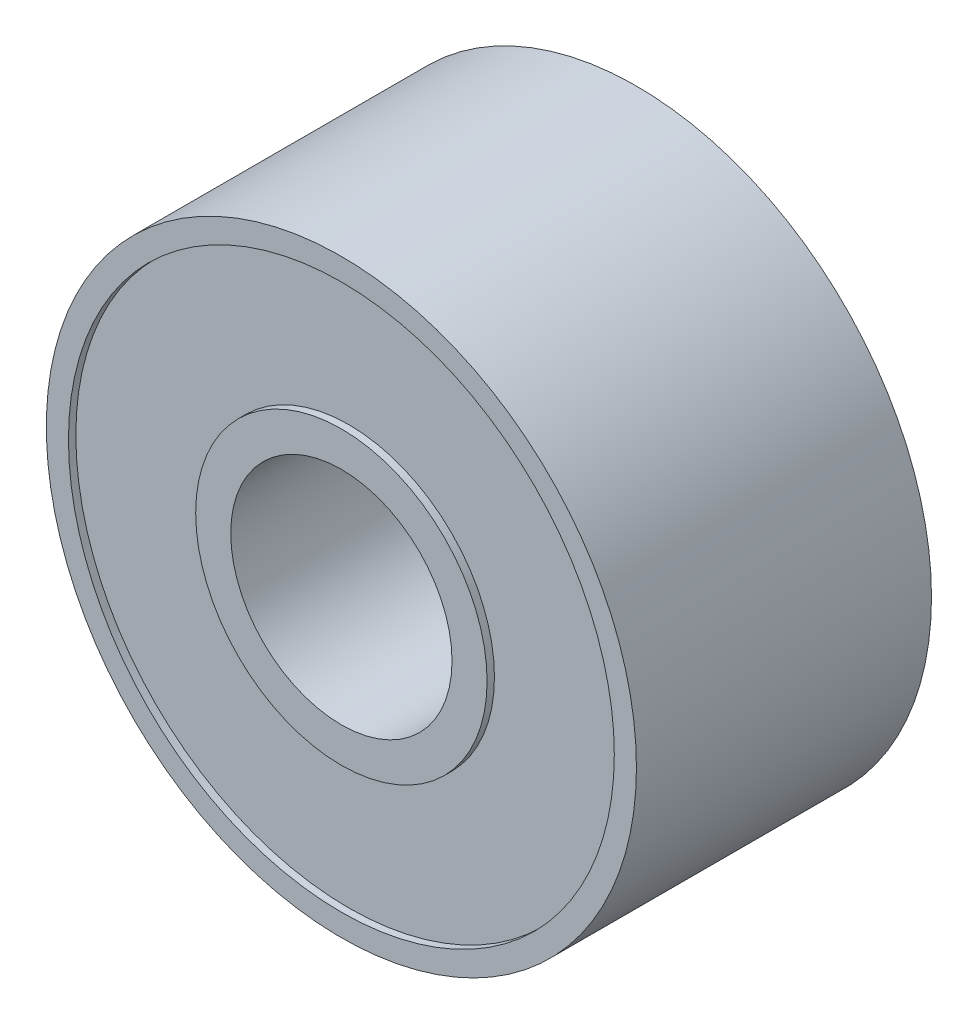
ISO-10303-21;
HEADER;
FILE_DESCRIPTION(('STEP AP214'),'2;1');
FILE_NAME('part.step','',(''),(''),'','','');
FILE_SCHEMA(('AUTOMOTIVE_DESIGN { 1 0 10303 214 1 1 1 1 }'));
ENDSEC;
DATA;
#1=APPLICATION_CONTEXT('core data for automotive mechanical design processes');
#2=APPLICATION_PROTOCOL_DEFINITION('international standard','automotive_design',2000,#1);
#3=PRODUCT_CONTEXT('',#1,'mechanical');
#4=PRODUCT('Part','Part','',(#3));
#5=PRODUCT_RELATED_PRODUCT_CATEGORY('part','',(#4));
#6=PRODUCT_DEFINITION_FORMATION('','',#4);
#7=PRODUCT_DEFINITION_CONTEXT('part definition',#1,'design');
#8=PRODUCT_DEFINITION('design','',#6,#7);
#9=PRODUCT_DEFINITION_SHAPE('','',#8);
#10=(LENGTH_UNIT() NAMED_UNIT(*) SI_UNIT(.MILLI.,.METRE.));
#11=(NAMED_UNIT(*) PLANE_ANGLE_UNIT() SI_UNIT($,.RADIAN.));
#12=(NAMED_UNIT(*) SI_UNIT($,.STERADIAN.) SOLID_ANGLE_UNIT());
#13=UNCERTAINTY_MEASURE_WITH_UNIT(LENGTH_MEASURE(1.E-05),#10,'distance_accuracy_value','');
#14=(GEOMETRIC_REPRESENTATION_CONTEXT(3) GLOBAL_UNCERTAINTY_ASSIGNED_CONTEXT((#13)) GLOBAL_UNIT_ASSIGNED_CONTEXT((#10,
#11,#12)) REPRESENTATION_CONTEXT('',''));
#15=CARTESIAN_POINT('',(0.,0.,0.));
#16=DIRECTION('',(0.,0.,1.));
#17=DIRECTION('',(1.,0.,0.));
#18=AXIS2_PLACEMENT_3D('',#15,#16,#17);
#19=CARTESIAN_POINT('',(0.,0.,0.));
#20=DIRECTION('',(0.,0.,1.));
#21=DIRECTION('',(1.,0.,0.));
#22=AXIS2_PLACEMENT_3D('',#19,#20,#21);
#23=PLANE('',#22);
#24=CARTESIAN_POINT('',(0.,0.,0.));
#25=DIRECTION('',(0.,0.,1.));
#26=DIRECTION('',(1.,0.,0.));
#27=AXIS2_PLACEMENT_3D('',#24,#25,#26);
#28=CIRCLE('',#27,1.5);
#29=CARTESIAN_POINT('',(1.5,0.,0.));
#30=VERTEX_POINT('',#29);
#31=EDGE_CURVE('E44',#30,#30,#28,.T.);
#32=ORIENTED_EDGE('',*,*,#31,.T.);
#33=EDGE_LOOP('',(#32));
#34=FACE_BOUND('',#33,.T.);
#35=CARTESIAN_POINT('',(0.,0.,0.));
#36=DIRECTION('',(0.,0.,-1.));
#37=DIRECTION('',(-1.,0.,0.));
#38=AXIS2_PLACEMENT_3D('',#35,#36,#37);
#39=CIRCLE('',#38,1.97517800346251);
#40=CARTESIAN_POINT('',(-1.97517800346251,0.,0.));
#41=VERTEX_POINT('',#40);
#42=EDGE_CURVE('E66',#41,#41,#39,.T.);
#43=ORIENTED_EDGE('',*,*,#42,.T.);
#44=EDGE_LOOP('',(#43));
#45=FACE_BOUND('',#44,.T.);
#46=ADVANCED_FACE('F31',(#34,#45),#23,.F.);
#47=CARTESIAN_POINT('',(0.,0.,4.));
#48=DIRECTION('',(0.,0.,1.));
#49=DIRECTION('',(1.,0.,0.));
#50=AXIS2_PLACEMENT_3D('',#47,#48,#49);
#51=PLANE('',#50);
#52=CARTESIAN_POINT('',(0.,0.,4.));
#53=DIRECTION('',(0.,0.,1.));
#54=DIRECTION('',(1.,0.,0.));
#55=AXIS2_PLACEMENT_3D('',#52,#53,#54);
#56=CIRCLE('',#55,1.5);
#57=CARTESIAN_POINT('',(1.5,0.,4.));
#58=VERTEX_POINT('',#57);
#59=EDGE_CURVE('E42',#58,#58,#56,.T.);
#60=ORIENTED_EDGE('',*,*,#59,.F.);
#61=EDGE_LOOP('',(#60));
#62=FACE_BOUND('',#61,.T.);
#63=CARTESIAN_POINT('',(0.,0.,4.));
#64=DIRECTION('',(0.,0.,1.));
#65=DIRECTION('',(1.,0.,0.));
#66=AXIS2_PLACEMENT_3D('',#63,#64,#65);
#67=CIRCLE('',#66,1.97517800346251);
#68=CARTESIAN_POINT('',(1.97517800346251,0.,4.));
#69=VERTEX_POINT('',#68);
#70=EDGE_CURVE('E56',#69,#69,#67,.T.);
#71=ORIENTED_EDGE('',*,*,#70,.T.);
#72=EDGE_LOOP('',(#71));
#73=FACE_BOUND('',#72,.T.);
#74=ADVANCED_FACE('F105',(#62,#73),#51,.T.);
#75=CARTESIAN_POINT('',(0.,0.,4.));
#76=DIRECTION('',(0.,0.,1.));
#77=DIRECTION('',(1.,0.,0.));
#78=AXIS2_PLACEMENT_3D('',#75,#76,#77);
#79=CIRCLE('',#78,3.7);
#80=CARTESIAN_POINT('',(3.7,0.,4.));
#81=VERTEX_POINT('',#80);
#82=EDGE_CURVE('E50',#81,#81,#79,.T.);
#83=ORIENTED_EDGE('',*,*,#82,.F.);
#84=EDGE_LOOP('',(#83));
#85=FACE_BOUND('',#84,.T.);
#86=CARTESIAN_POINT('',(0.,0.,4.));
#87=DIRECTION('',(0.,0.,1.));
#88=DIRECTION('',(1.,0.,0.));
#89=AXIS2_PLACEMENT_3D('',#86,#87,#88);
#90=CIRCLE('',#89,4.);
#91=CARTESIAN_POINT('',(4.,0.,4.));
#92=VERTEX_POINT('',#91);
#93=EDGE_CURVE('E10',#92,#92,#90,.T.);
#94=ORIENTED_EDGE('',*,*,#93,.T.);
#95=EDGE_LOOP('',(#94));
#96=FACE_BOUND('',#95,.T.);
#97=ADVANCED_FACE('F92',(#85,#96),#51,.T.);
#98=CARTESIAN_POINT('',(0.,0.,0.));
#99=DIRECTION('',(0.,0.,-1.));
#100=DIRECTION('',(-1.,0.,0.));
#101=AXIS2_PLACEMENT_3D('',#98,#99,#100);
#102=CIRCLE('',#101,3.7);
#103=CARTESIAN_POINT('',(-3.7,0.,0.));
#104=VERTEX_POINT('',#103);
#105=EDGE_CURVE('E62',#104,#104,#102,.T.);
#106=ORIENTED_EDGE('',*,*,#105,.F.);
#107=EDGE_LOOP('',(#106));
#108=FACE_BOUND('',#107,.T.);
#109=CARTESIAN_POINT('',(0.,0.,0.));
#110=DIRECTION('',(0.,0.,1.));
#111=DIRECTION('',(1.,0.,0.));
#112=AXIS2_PLACEMENT_3D('',#109,#110,#111);
#113=CIRCLE('',#112,4.);
#114=CARTESIAN_POINT('',(4.,0.,0.));
#115=VERTEX_POINT('',#114);
#116=EDGE_CURVE('E35',#115,#115,#113,.T.);
#117=ORIENTED_EDGE('',*,*,#116,.F.);
#118=EDGE_LOOP('',(#117));
#119=FACE_BOUND('',#118,.T.);
#120=ADVANCED_FACE('F89',(#108,#119),#23,.F.);
#121=CARTESIAN_POINT('',(0.,0.,4.));
#122=DIRECTION('',(0.,0.,-1.));
#123=DIRECTION('',(-1.,0.,0.));
#124=AXIS2_PLACEMENT_3D('',#121,#122,#123);
#125=CYLINDRICAL_SURFACE('',#124,4.);
#126=ORIENTED_EDGE('',*,*,#93,.F.);
#127=EDGE_LOOP('',(#126));
#128=FACE_BOUND('',#127,.T.);
#129=ORIENTED_EDGE('',*,*,#116,.T.);
#130=EDGE_LOOP('',(#129));
#131=FACE_BOUND('',#130,.T.);
#132=ADVANCED_FACE('F33',(#128,#131),#125,.T.);
#133=CARTESIAN_POINT('',(0.,0.,4.));
#134=DIRECTION('',(0.,0.,-1.));
#135=DIRECTION('',(-1.,0.,0.));
#136=AXIS2_PLACEMENT_3D('',#133,#134,#135);
#137=CYLINDRICAL_SURFACE('',#136,1.5);
#138=ORIENTED_EDGE('',*,*,#59,.T.);
#139=EDGE_LOOP('',(#138));
#140=FACE_BOUND('',#139,.T.);
#141=ORIENTED_EDGE('',*,*,#31,.F.);
#142=EDGE_LOOP('',(#141));
#143=FACE_BOUND('',#142,.T.);
#144=ADVANCED_FACE('F96',(#140,#143),#137,.F.);
#145=CARTESIAN_POINT('',(0.,0.,3.9));
#146=DIRECTION('',(0.,0.,1.));
#147=DIRECTION('',(1.,0.,0.));
#148=AXIS2_PLACEMENT_3D('',#145,#146,#147);
#149=CYLINDRICAL_SURFACE('',#148,3.7);
#150=CARTESIAN_POINT('',(0.,0.,3.9));
#151=DIRECTION('',(0.,0.,1.));
#152=DIRECTION('',(1.,0.,0.));
#153=AXIS2_PLACEMENT_3D('',#150,#151,#152);
#154=CIRCLE('',#153,3.7);
#155=CARTESIAN_POINT('',(3.7,0.,3.9));
#156=VERTEX_POINT('',#155);
#157=EDGE_CURVE('E47',#156,#156,#154,.T.);
#158=ORIENTED_EDGE('',*,*,#157,.F.);
#159=EDGE_LOOP('',(#158));
#160=FACE_BOUND('',#159,.T.);
#161=ORIENTED_EDGE('',*,*,#82,.T.);
#162=EDGE_LOOP('',(#161));
#163=FACE_BOUND('',#162,.T.);
#164=ADVANCED_FACE('F101',(#160,#163),#149,.F.);
#165=CARTESIAN_POINT('',(0.,0.,3.9));
#166=DIRECTION('',(0.,0.,1.));
#167=DIRECTION('',(1.,0.,0.));
#168=AXIS2_PLACEMENT_3D('',#165,#166,#167);
#169=PLANE('',#168);
#170=CARTESIAN_POINT('',(0.,0.,3.9));
#171=DIRECTION('',(0.,0.,1.));
#172=DIRECTION('',(1.,0.,0.));
#173=AXIS2_PLACEMENT_3D('',#170,#171,#172);
#174=CIRCLE('',#173,1.97517800346251);
#175=CARTESIAN_POINT('',(1.97517800346251,0.,3.9));
#176=VERTEX_POINT('',#175);
#177=EDGE_CURVE('E53',#176,#176,#174,.T.);
#178=ORIENTED_EDGE('',*,*,#177,.F.);
#179=EDGE_LOOP('',(#178));
#180=FACE_BOUND('',#179,.T.);
#181=ORIENTED_EDGE('',*,*,#157,.T.);
#182=EDGE_LOOP('',(#181));
#183=FACE_BOUND('',#182,.T.);
#184=ADVANCED_FACE('F118',(#180,#183),#169,.T.);
#185=CARTESIAN_POINT('',(0.,0.,3.9));
#186=DIRECTION('',(0.,0.,1.));
#187=DIRECTION('',(1.,0.,0.));
#188=AXIS2_PLACEMENT_3D('',#185,#186,#187);
#189=CYLINDRICAL_SURFACE('',#188,1.97517800346251);
#190=ORIENTED_EDGE('',*,*,#177,.T.);
#191=EDGE_LOOP('',(#190));
#192=FACE_BOUND('',#191,.T.);
#193=ORIENTED_EDGE('',*,*,#70,.F.);
#194=EDGE_LOOP('',(#193));
#195=FACE_BOUND('',#194,.T.);
#196=ADVANCED_FACE('F122',(#192,#195),#189,.T.);
#197=CARTESIAN_POINT('',(0.,0.,0.1));
#198=DIRECTION('',(0.,0.,-1.));
#199=DIRECTION('',(-1.,0.,0.));
#200=AXIS2_PLACEMENT_3D('',#197,#198,#199);
#201=CYLINDRICAL_SURFACE('',#200,1.97517800346251);
#202=CARTESIAN_POINT('',(0.,0.,0.1));
#203=DIRECTION('',(0.,0.,-1.));
#204=DIRECTION('',(-1.,0.,0.));
#205=AXIS2_PLACEMENT_3D('',#202,#203,#204);
#206=CIRCLE('',#205,1.97517800346251);
#207=CARTESIAN_POINT('',(-1.97517800346251,0.,0.1));
#208=VERTEX_POINT('',#207);
#209=EDGE_CURVE('E65',#208,#208,#206,.T.);
#210=ORIENTED_EDGE('',*,*,#209,.T.);
#211=EDGE_LOOP('',(#210));
#212=FACE_BOUND('',#211,.T.);
#213=ORIENTED_EDGE('',*,*,#42,.F.);
#214=EDGE_LOOP('',(#213));
#215=FACE_BOUND('',#214,.T.);
#216=ADVANCED_FACE('F74',(#212,#215),#201,.T.);
#217=CARTESIAN_POINT('',(0.,0.,0.1));
#218=DIRECTION('',(0.,0.,-1.));
#219=DIRECTION('',(-1.,0.,0.));
#220=AXIS2_PLACEMENT_3D('',#217,#218,#219);
#221=CYLINDRICAL_SURFACE('',#220,3.7);
#222=CARTESIAN_POINT('',(0.,0.,0.1));
#223=DIRECTION('',(0.,0.,-1.));
#224=DIRECTION('',(-1.,0.,0.));
#225=AXIS2_PLACEMENT_3D('',#222,#223,#224);
#226=CIRCLE('',#225,3.7);
#227=CARTESIAN_POINT('',(-3.7,0.,0.1));
#228=VERTEX_POINT('',#227);
#229=EDGE_CURVE('E59',#228,#228,#226,.T.);
#230=ORIENTED_EDGE('',*,*,#229,.F.);
#231=EDGE_LOOP('',(#230));
#232=FACE_BOUND('',#231,.T.);
#233=ORIENTED_EDGE('',*,*,#105,.T.);
#234=EDGE_LOOP('',(#233));
#235=FACE_BOUND('',#234,.T.);
#236=ADVANCED_FACE('F80',(#232,#235),#221,.F.);
#237=CARTESIAN_POINT('',(0.,0.,0.1));
#238=DIRECTION('',(0.,0.,-1.));
#239=DIRECTION('',(-1.,0.,0.));
#240=AXIS2_PLACEMENT_3D('',#237,#238,#239);
#241=PLANE('',#240);
#242=ORIENTED_EDGE('',*,*,#209,.F.);
#243=EDGE_LOOP('',(#242));
#244=FACE_BOUND('',#243,.T.);
#245=ORIENTED_EDGE('',*,*,#229,.T.);
#246=EDGE_LOOP('',(#245));
#247=FACE_BOUND('',#246,.T.);
#248=ADVANCED_FACE('F77',(#244,#247),#241,.T.);
#249=CLOSED_SHELL('',(#46,#74,#97,#120,#132,#144,#164,#184,#196,#216,#236,#248));
#250=MANIFOLD_SOLID_BREP('B2',#249);
#251=ADVANCED_BREP_SHAPE_REPRESENTATION('',(#18,#250),#14);
#252=SHAPE_DEFINITION_REPRESENTATION(#9,#251);
ENDSEC;
END-ISO-10303-21;
